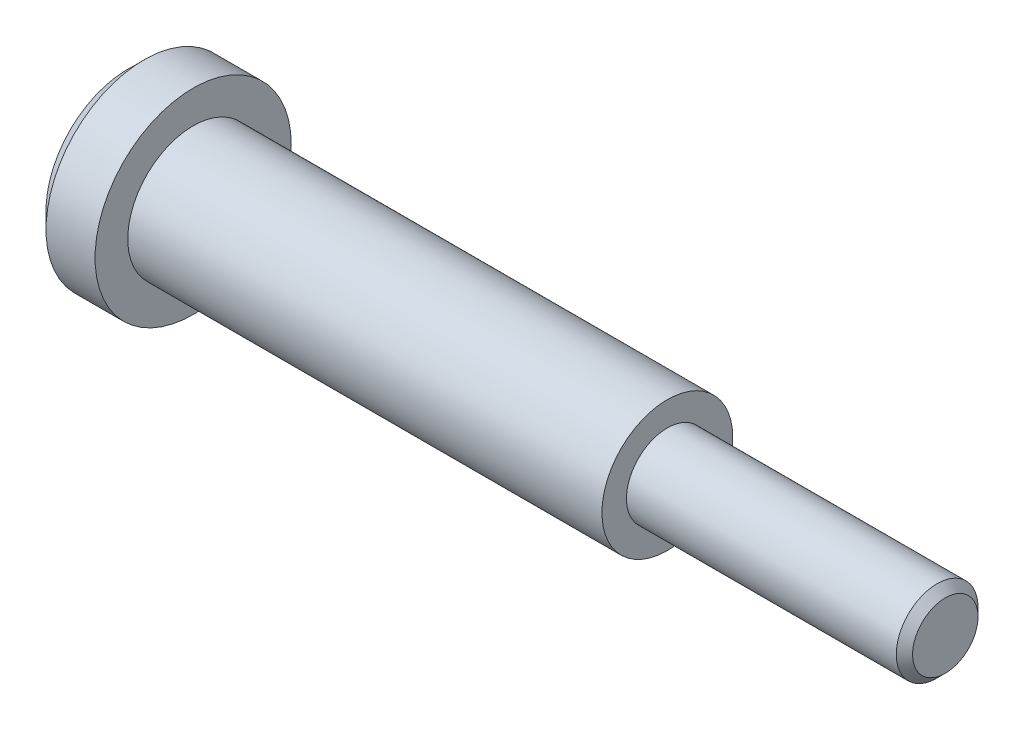
ISO-10303-21;
HEADER;
FILE_DESCRIPTION(('STEP AP214'),'2;1');
FILE_NAME('part.step','',(''),(''),'','','');
FILE_SCHEMA(('AUTOMOTIVE_DESIGN { 1 0 10303 214 1 1 1 1 }'));
ENDSEC;
DATA;
#1=APPLICATION_CONTEXT('core data for automotive mechanical design processes');
#2=APPLICATION_PROTOCOL_DEFINITION('international standard','automotive_design',2000,#1);
#3=PRODUCT_CONTEXT('',#1,'mechanical');
#4=PRODUCT('Part','Part','',(#3));
#5=PRODUCT_RELATED_PRODUCT_CATEGORY('part','',(#4));
#6=PRODUCT_DEFINITION_FORMATION('','',#4);
#7=PRODUCT_DEFINITION_CONTEXT('part definition',#1,'design');
#8=PRODUCT_DEFINITION('design','',#6,#7);
#9=PRODUCT_DEFINITION_SHAPE('','',#8);
#10=(LENGTH_UNIT() NAMED_UNIT(*) SI_UNIT(.MILLI.,.METRE.));
#11=(NAMED_UNIT(*) PLANE_ANGLE_UNIT() SI_UNIT($,.RADIAN.));
#12=(NAMED_UNIT(*) SI_UNIT($,.STERADIAN.) SOLID_ANGLE_UNIT());
#13=UNCERTAINTY_MEASURE_WITH_UNIT(LENGTH_MEASURE(1.E-05),#10,'distance_accuracy_value','');
#14=(GEOMETRIC_REPRESENTATION_CONTEXT(3) GLOBAL_UNCERTAINTY_ASSIGNED_CONTEXT((#13)) GLOBAL_UNIT_ASSIGNED_CONTEXT((#10,
#11,#12)) REPRESENTATION_CONTEXT('',''));
#15=CARTESIAN_POINT('',(0.,0.,0.));
#16=DIRECTION('',(0.,0.,1.));
#17=DIRECTION('',(1.,0.,0.));
#18=AXIS2_PLACEMENT_3D('',#15,#16,#17);
#19=CARTESIAN_POINT('',(4.,0.,0.));
#20=DIRECTION('',(-1.,0.,0.));
#21=DIRECTION('',(0.,0.,1.));
#22=AXIS2_PLACEMENT_3D('',#19,#20,#21);
#23=CYLINDRICAL_SURFACE('',#22,6.);
#24=CARTESIAN_POINT('',(1.00000000000002,0.,0.));
#25=DIRECTION('',(1.,0.,0.));
#26=DIRECTION('',(0.,0.,-1.));
#27=AXIS2_PLACEMENT_3D('',#24,#25,#26);
#28=CIRCLE('',#27,6.);
#29=CARTESIAN_POINT('',(1.00000000000002,0.,-6.));
#30=VERTEX_POINT('',#29);
#31=EDGE_CURVE('E45',#30,#30,#28,.T.);
#32=ORIENTED_EDGE('',*,*,#31,.T.);
#33=EDGE_LOOP('',(#32));
#34=FACE_BOUND('',#33,.T.);
#35=CARTESIAN_POINT('',(4.,0.,0.));
#36=DIRECTION('',(1.,0.,0.));
#37=DIRECTION('',(0.,0.,-1.));
#38=AXIS2_PLACEMENT_3D('',#35,#36,#37);
#39=CIRCLE('',#38,6.);
#40=CARTESIAN_POINT('',(4.,0.,-6.));
#41=VERTEX_POINT('',#40);
#42=EDGE_CURVE('E57',#41,#41,#39,.T.);
#43=ORIENTED_EDGE('',*,*,#42,.F.);
#44=EDGE_LOOP('',(#43));
#45=FACE_BOUND('',#44,.T.);
#46=ADVANCED_FACE('F30',(#34,#45),#23,.T.);
#47=CARTESIAN_POINT('',(4.,0.,0.));
#48=DIRECTION('',(1.,0.,0.));
#49=DIRECTION('',(0.,0.,-1.));
#50=AXIS2_PLACEMENT_3D('',#47,#48,#49);
#51=PLANE('',#50);
#52=CARTESIAN_POINT('',(4.,0.,0.));
#53=DIRECTION('',(1.,0.,0.));
#54=DIRECTION('',(0.,0.,-1.));
#55=AXIS2_PLACEMENT_3D('',#52,#53,#54);
#56=CIRCLE('',#55,4.);
#57=CARTESIAN_POINT('',(4.,0.,-4.));
#58=VERTEX_POINT('',#57);
#59=EDGE_CURVE('E60',#58,#58,#56,.T.);
#60=ORIENTED_EDGE('',*,*,#59,.F.);
#61=EDGE_LOOP('',(#60));
#62=FACE_BOUND('',#61,.T.);
#63=ORIENTED_EDGE('',*,*,#42,.T.);
#64=EDGE_LOOP('',(#63));
#65=FACE_BOUND('',#64,.T.);
#66=ADVANCED_FACE('F87',(#62,#65),#51,.T.);
#67=CARTESIAN_POINT('',(0.,0.,0.));
#68=DIRECTION('',(1.,0.,0.));
#69=DIRECTION('',(0.,0.,-1.));
#70=AXIS2_PLACEMENT_3D('',#67,#68,#69);
#71=PLANE('',#70);
#72=CARTESIAN_POINT('',(0.,0.,0.));
#73=DIRECTION('',(1.,0.,0.));
#74=DIRECTION('',(0.,0.,-1.));
#75=AXIS2_PLACEMENT_3D('',#72,#73,#74);
#76=CIRCLE('',#75,3.);
#77=CARTESIAN_POINT('',(0.,0.,-3.));
#78=VERTEX_POINT('',#77);
#79=EDGE_CURVE('E10',#78,#78,#76,.T.);
#80=ORIENTED_EDGE('',*,*,#79,.T.);
#81=EDGE_LOOP('',(#80));
#82=FACE_BOUND('',#81,.T.);
#83=CARTESIAN_POINT('',(0.,0.,0.));
#84=DIRECTION('',(1.,0.,0.));
#85=DIRECTION('',(0.,0.,-1.));
#86=AXIS2_PLACEMENT_3D('',#83,#84,#85);
#87=CIRCLE('',#86,4.99999999999998);
#88=CARTESIAN_POINT('',(0.,0.,-4.99999999999998));
#89=VERTEX_POINT('',#88);
#90=EDGE_CURVE('E41',#89,#89,#87,.F.);
#91=ORIENTED_EDGE('',*,*,#90,.T.);
#92=EDGE_LOOP('',(#91));
#93=FACE_BOUND('',#92,.T.);
#94=ADVANCED_FACE('F93',(#82,#93),#71,.F.);
#95=CARTESIAN_POINT('',(33.,0.,0.));
#96=DIRECTION('',(-1.,0.,0.));
#97=DIRECTION('',(0.,0.,1.));
#98=AXIS2_PLACEMENT_3D('',#95,#96,#97);
#99=CYLINDRICAL_SURFACE('',#98,4.);
#100=CARTESIAN_POINT('',(33.,0.,0.));
#101=DIRECTION('',(1.,0.,0.));
#102=DIRECTION('',(0.,0.,-1.));
#103=AXIS2_PLACEMENT_3D('',#100,#101,#102);
#104=CIRCLE('',#103,4.);
#105=CARTESIAN_POINT('',(33.,0.,-4.));
#106=VERTEX_POINT('',#105);
#107=EDGE_CURVE('E61',#106,#106,#104,.T.);
#108=ORIENTED_EDGE('',*,*,#107,.F.);
#109=EDGE_LOOP('',(#108));
#110=FACE_BOUND('',#109,.T.);
#111=ORIENTED_EDGE('',*,*,#59,.T.);
#112=EDGE_LOOP('',(#111));
#113=FACE_BOUND('',#112,.T.);
#114=ADVANCED_FACE('F119',(#110,#113),#99,.T.);
#115=CARTESIAN_POINT('',(33.,0.,0.));
#116=DIRECTION('',(1.,0.,0.));
#117=DIRECTION('',(0.,0.,-1.));
#118=AXIS2_PLACEMENT_3D('',#115,#116,#117);
#119=PLANE('',#118);
#120=CARTESIAN_POINT('',(33.,0.,0.));
#121=DIRECTION('',(1.,0.,0.));
#122=DIRECTION('',(0.,0.,-1.));
#123=AXIS2_PLACEMENT_3D('',#120,#121,#122);
#124=CIRCLE('',#123,2.5);
#125=CARTESIAN_POINT('',(33.,0.,-2.5));
#126=VERTEX_POINT('',#125);
#127=EDGE_CURVE('E56',#126,#126,#124,.T.);
#128=ORIENTED_EDGE('',*,*,#127,.F.);
#129=EDGE_LOOP('',(#128));
#130=FACE_BOUND('',#129,.T.);
#131=ORIENTED_EDGE('',*,*,#107,.T.);
#132=EDGE_LOOP('',(#131));
#133=FACE_BOUND('',#132,.T.);
#134=ADVANCED_FACE('F113',(#130,#133),#119,.T.);
#135=CARTESIAN_POINT('',(50.,0.,0.));
#136=DIRECTION('',(-1.,0.,0.));
#137=DIRECTION('',(0.,0.,1.));
#138=AXIS2_PLACEMENT_3D('',#135,#136,#137);
#139=CYLINDRICAL_SURFACE('',#138,2.5);
#140=CARTESIAN_POINT('',(49.5,0.,0.));
#141=DIRECTION('',(1.,0.,0.));
#142=DIRECTION('',(0.,0.,-1.));
#143=AXIS2_PLACEMENT_3D('',#140,#141,#142);
#144=CIRCLE('',#143,2.5);
#145=CARTESIAN_POINT('',(49.5,0.,-2.5));
#146=VERTEX_POINT('',#145);
#147=EDGE_CURVE('E50',#146,#146,#144,.F.);
#148=ORIENTED_EDGE('',*,*,#147,.T.);
#149=EDGE_LOOP('',(#148));
#150=FACE_BOUND('',#149,.T.);
#151=ORIENTED_EDGE('',*,*,#127,.T.);
#152=EDGE_LOOP('',(#151));
#153=FACE_BOUND('',#152,.T.);
#154=ADVANCED_FACE('F105',(#150,#153),#139,.T.);
#155=CARTESIAN_POINT('',(50.,0.,0.));
#156=DIRECTION('',(1.,0.,0.));
#157=DIRECTION('',(0.,0.,-1.));
#158=AXIS2_PLACEMENT_3D('',#155,#156,#157);
#159=PLANE('',#158);
#160=CARTESIAN_POINT('',(50.,0.,0.));
#161=DIRECTION('',(1.,0.,0.));
#162=DIRECTION('',(0.,0.,-1.));
#163=AXIS2_PLACEMENT_3D('',#160,#161,#162);
#164=CIRCLE('',#163,1.99999999999999);
#165=CARTESIAN_POINT('',(50.,0.,-1.99999999999999));
#166=VERTEX_POINT('',#165);
#167=EDGE_CURVE('E53',#166,#166,#164,.T.);
#168=ORIENTED_EDGE('',*,*,#167,.T.);
#169=EDGE_LOOP('',(#168));
#170=FACE_BOUND('',#169,.T.);
#171=ADVANCED_FACE('F100',(#170),#159,.T.);
#172=CARTESIAN_POINT('',(50.,0.,0.));
#173=DIRECTION('',(-1.,0.,0.));
#174=DIRECTION('',(0.,0.,1.));
#175=AXIS2_PLACEMENT_3D('',#172,#173,#174);
#176=CONICAL_SURFACE('',#175,1.99999999999999,0.785398163397446);
#177=ORIENTED_EDGE('',*,*,#147,.F.);
#178=EDGE_LOOP('',(#177));
#179=FACE_BOUND('',#178,.T.);
#180=ORIENTED_EDGE('',*,*,#167,.F.);
#181=EDGE_LOOP('',(#180));
#182=FACE_BOUND('',#181,.T.);
#183=ADVANCED_FACE('F83',(#179,#182),#176,.T.);
#184=CARTESIAN_POINT('',(1.00000000000002,0.,0.));
#185=DIRECTION('',(1.,0.,0.));
#186=DIRECTION('',(0.,0.,-1.));
#187=AXIS2_PLACEMENT_3D('',#184,#185,#186);
#188=CONICAL_SURFACE('',#187,6.,0.785398163397452);
#189=ORIENTED_EDGE('',*,*,#90,.F.);
#190=EDGE_LOOP('',(#189));
#191=FACE_BOUND('',#190,.T.);
#192=ORIENTED_EDGE('',*,*,#31,.F.);
#193=EDGE_LOOP('',(#192));
#194=FACE_BOUND('',#193,.T.);
#195=ADVANCED_FACE('F76',(#191,#194),#188,.T.);
#196=CARTESIAN_POINT('',(1.,0.,0.));
#197=DIRECTION('',(-1.,0.,0.));
#198=DIRECTION('',(0.,0.,1.));
#199=AXIS2_PLACEMENT_3D('',#196,#197,#198);
#200=CYLINDRICAL_SURFACE('',#199,2.5);
#201=CARTESIAN_POINT('',(0.5,0.,0.));
#202=DIRECTION('',(1.,0.,0.));
#203=DIRECTION('',(0.,0.,-1.));
#204=AXIS2_PLACEMENT_3D('',#201,#202,#203);
#205=CIRCLE('',#204,2.5);
#206=CARTESIAN_POINT('',(0.5,0.,-2.5));
#207=VERTEX_POINT('',#206);
#208=EDGE_CURVE('E37',#207,#207,#205,.F.);
#209=ORIENTED_EDGE('',*,*,#208,.T.);
#210=EDGE_LOOP('',(#209));
#211=FACE_BOUND('',#210,.T.);
#212=CARTESIAN_POINT('',(1.,0.,0.));
#213=DIRECTION('',(-1.,0.,0.));
#214=DIRECTION('',(0.,0.,1.));
#215=AXIS2_PLACEMENT_3D('',#212,#213,#214);
#216=CIRCLE('',#215,2.5);
#217=CARTESIAN_POINT('',(1.,0.,2.5));
#218=VERTEX_POINT('',#217);
#219=EDGE_CURVE('E66',#218,#218,#216,.T.);
#220=ORIENTED_EDGE('',*,*,#219,.F.);
#221=EDGE_LOOP('',(#220));
#222=FACE_BOUND('',#221,.T.);
#223=ADVANCED_FACE('F74',(#211,#222),#200,.F.);
#224=CARTESIAN_POINT('',(1.,0.,0.));
#225=DIRECTION('',(-1.,0.,0.));
#226=DIRECTION('',(0.,0.,1.));
#227=AXIS2_PLACEMENT_3D('',#224,#225,#226);
#228=PLANE('',#227);
#229=ORIENTED_EDGE('',*,*,#219,.T.);
#230=EDGE_LOOP('',(#229));
#231=FACE_BOUND('',#230,.T.);
#232=ADVANCED_FACE('F72',(#231),#228,.T.);
#233=CARTESIAN_POINT('',(0.5,0.,0.));
#234=DIRECTION('',(1.,0.,0.));
#235=DIRECTION('',(0.,0.,-1.));
#236=AXIS2_PLACEMENT_3D('',#233,#234,#235);
#237=TOROIDAL_SURFACE('',#236,3.,0.5);
#238=ORIENTED_EDGE('',*,*,#79,.F.);
#239=EDGE_LOOP('',(#238));
#240=FACE_BOUND('',#239,.T.);
#241=ORIENTED_EDGE('',*,*,#208,.F.);
#242=EDGE_LOOP('',(#241));
#243=FACE_BOUND('',#242,.T.);
#244=ADVANCED_FACE('F32',(#240,#243),#237,.T.);
#245=CLOSED_SHELL('',(#46,#66,#94,#114,#134,#154,#171,#183,#195,#223,#232,#244));
#246=MANIFOLD_SOLID_BREP('B2',#245);
#247=ADVANCED_BREP_SHAPE_REPRESENTATION('',(#18,#246),#14);
#248=SHAPE_DEFINITION_REPRESENTATION(#9,#247);
ENDSEC;
END-ISO-10303-21;
